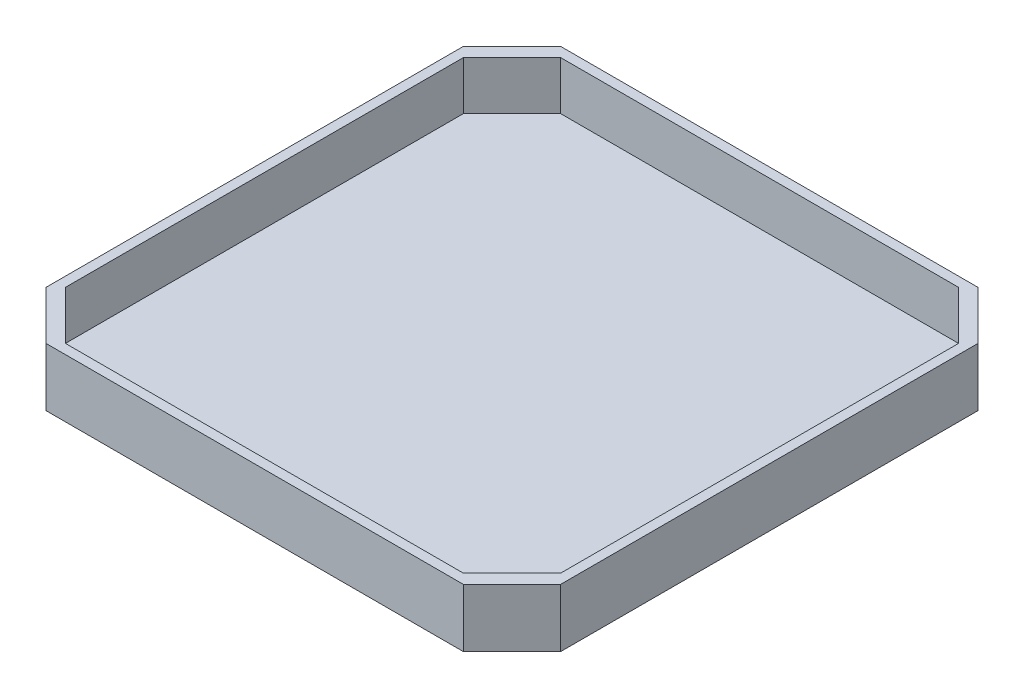
ISO-10303-21;
HEADER;
FILE_DESCRIPTION(('STEP AP214'),'2;1');
FILE_NAME('part.step','',(''),(''),'','','');
FILE_SCHEMA(('AUTOMOTIVE_DESIGN { 1 0 10303 214 1 1 1 1 }'));
ENDSEC;
DATA;
#1=APPLICATION_CONTEXT('core data for automotive mechanical design processes');
#2=APPLICATION_PROTOCOL_DEFINITION('international standard','automotive_design',2000,#1);
#3=PRODUCT_CONTEXT('',#1,'mechanical');
#4=PRODUCT('Part','Part','',(#3));
#5=PRODUCT_RELATED_PRODUCT_CATEGORY('part','',(#4));
#6=PRODUCT_DEFINITION_FORMATION('','',#4);
#7=PRODUCT_DEFINITION_CONTEXT('part definition',#1,'design');
#8=PRODUCT_DEFINITION('design','',#6,#7);
#9=PRODUCT_DEFINITION_SHAPE('','',#8);
#10=(LENGTH_UNIT() NAMED_UNIT(*) SI_UNIT(.MILLI.,.METRE.));
#11=(NAMED_UNIT(*) PLANE_ANGLE_UNIT() SI_UNIT($,.RADIAN.));
#12=(NAMED_UNIT(*) SI_UNIT($,.STERADIAN.) SOLID_ANGLE_UNIT());
#13=UNCERTAINTY_MEASURE_WITH_UNIT(LENGTH_MEASURE(1.E-05),#10,'distance_accuracy_value','');
#14=(GEOMETRIC_REPRESENTATION_CONTEXT(3) GLOBAL_UNCERTAINTY_ASSIGNED_CONTEXT((#13)) GLOBAL_UNIT_ASSIGNED_CONTEXT((#10,
#11,#12)) REPRESENTATION_CONTEXT('',''));
#15=CARTESIAN_POINT('',(0.,0.,0.));
#16=DIRECTION('',(0.,0.,1.));
#17=DIRECTION('',(1.,0.,0.));
#18=AXIS2_PLACEMENT_3D('',#15,#16,#17);
#19=CARTESIAN_POINT('',(-53.,2.,-53.));
#20=DIRECTION('',(1.,0.,0.));
#21=DIRECTION('',(0.,0.,-1.));
#22=AXIS2_PLACEMENT_3D('',#19,#20,#21);
#23=PLANE('',#22);
#24=DIRECTION('',(0.,0.,1.));
#25=VECTOR('',#24,1.);
#26=CARTESIAN_POINT('',(-53.,12.,-53.));
#27=LINE('',#26,#25);
#28=CARTESIAN_POINT('',(-53.,12.,-43.));
#29=VERTEX_POINT('',#28);
#30=CARTESIAN_POINT('',(-53.,12.,43.));
#31=VERTEX_POINT('',#30);
#32=EDGE_CURVE('E241',#29,#31,#27,.T.);
#33=ORIENTED_EDGE('',*,*,#32,.F.);
#34=DIRECTION('',(0.,-1.,0.));
#35=VECTOR('',#34,1.);
#36=CARTESIAN_POINT('',(-53.,2.,-43.));
#37=LINE('',#36,#35);
#38=CARTESIAN_POINT('',(-53.,0.,-43.));
#39=VERTEX_POINT('',#38);
#40=EDGE_CURVE('E213',#29,#39,#37,.T.);
#41=ORIENTED_EDGE('',*,*,#40,.T.);
#42=DIRECTION('',(0.,0.,1.));
#43=VECTOR('',#42,1.);
#44=CARTESIAN_POINT('',(-53.,0.,-53.));
#45=LINE('',#44,#43);
#46=CARTESIAN_POINT('',(-53.,0.,43.));
#47=VERTEX_POINT('',#46);
#48=EDGE_CURVE('E258',#39,#47,#45,.T.);
#49=ORIENTED_EDGE('',*,*,#48,.T.);
#50=DIRECTION('',(0.,1.,0.));
#51=VECTOR('',#50,1.);
#52=CARTESIAN_POINT('',(-53.,2.,43.));
#53=LINE('',#52,#51);
#54=EDGE_CURVE('E211',#47,#31,#53,.T.);
#55=ORIENTED_EDGE('',*,*,#54,.T.);
#56=EDGE_LOOP('',(#33,#41,#49,#55));
#57=FACE_BOUND('',#56,.T.);
#58=ADVANCED_FACE('F35',(#57),#23,.F.);
#59=CARTESIAN_POINT('',(-53.,2.,53.));
#60=DIRECTION('',(0.,0.,-1.));
#61=DIRECTION('',(-1.,0.,0.));
#62=AXIS2_PLACEMENT_3D('',#59,#60,#61);
#63=PLANE('',#62);
#64=DIRECTION('',(1.,0.,0.));
#65=VECTOR('',#64,1.);
#66=CARTESIAN_POINT('',(-53.,0.,53.));
#67=LINE('',#66,#65);
#68=CARTESIAN_POINT('',(-43.,0.,53.));
#69=VERTEX_POINT('',#68);
#70=CARTESIAN_POINT('',(43.,0.,53.));
#71=VERTEX_POINT('',#70);
#72=EDGE_CURVE('E272',#69,#71,#67,.T.);
#73=ORIENTED_EDGE('',*,*,#72,.T.);
#74=DIRECTION('',(0.,1.,0.));
#75=VECTOR('',#74,1.);
#76=CARTESIAN_POINT('',(43.,2.,53.));
#77=LINE('',#76,#75);
#78=CARTESIAN_POINT('',(43.,12.,53.));
#79=VERTEX_POINT('',#78);
#80=EDGE_CURVE('E219',#71,#79,#77,.T.);
#81=ORIENTED_EDGE('',*,*,#80,.T.);
#82=DIRECTION('',(1.,0.,0.));
#83=VECTOR('',#82,1.);
#84=CARTESIAN_POINT('',(-53.,12.,53.));
#85=LINE('',#84,#83);
#86=CARTESIAN_POINT('',(-43.,12.,53.));
#87=VERTEX_POINT('',#86);
#88=EDGE_CURVE('E252',#87,#79,#85,.T.);
#89=ORIENTED_EDGE('',*,*,#88,.F.);
#90=DIRECTION('',(0.,-1.,0.));
#91=VECTOR('',#90,1.);
#92=CARTESIAN_POINT('',(-43.,2.,53.));
#93=LINE('',#92,#91);
#94=EDGE_CURVE('E216',#87,#69,#93,.T.);
#95=ORIENTED_EDGE('',*,*,#94,.T.);
#96=EDGE_LOOP('',(#73,#81,#89,#95));
#97=FACE_BOUND('',#96,.T.);
#98=ADVANCED_FACE('F329',(#97),#63,.F.);
#99=CARTESIAN_POINT('',(53.,2.,-53.));
#100=DIRECTION('',(-1.,0.,0.));
#101=DIRECTION('',(0.,0.,1.));
#102=AXIS2_PLACEMENT_3D('',#99,#100,#101);
#103=PLANE('',#102);
#104=DIRECTION('',(0.,0.,-1.));
#105=VECTOR('',#104,1.);
#106=CARTESIAN_POINT('',(53.,0.,-53.));
#107=LINE('',#106,#105);
#108=CARTESIAN_POINT('',(53.,0.,43.));
#109=VERTEX_POINT('',#108);
#110=CARTESIAN_POINT('',(53.,0.,-43.));
#111=VERTEX_POINT('',#110);
#112=EDGE_CURVE('E174',#109,#111,#107,.T.);
#113=ORIENTED_EDGE('',*,*,#112,.T.);
#114=DIRECTION('',(0.,1.,0.));
#115=VECTOR('',#114,1.);
#116=CARTESIAN_POINT('',(53.,2.,-43.));
#117=LINE('',#116,#115);
#118=CARTESIAN_POINT('',(53.,12.,-43.));
#119=VERTEX_POINT('',#118);
#120=EDGE_CURVE('E209',#111,#119,#117,.T.);
#121=ORIENTED_EDGE('',*,*,#120,.T.);
#122=DIRECTION('',(0.,0.,-1.));
#123=VECTOR('',#122,1.);
#124=CARTESIAN_POINT('',(53.,12.,53.));
#125=LINE('',#124,#123);
#126=CARTESIAN_POINT('',(53.,12.,43.));
#127=VERTEX_POINT('',#126);
#128=EDGE_CURVE('E277',#127,#119,#125,.T.);
#129=ORIENTED_EDGE('',*,*,#128,.F.);
#130=DIRECTION('',(0.,-1.,0.));
#131=VECTOR('',#130,1.);
#132=CARTESIAN_POINT('',(53.,2.,43.));
#133=LINE('',#132,#131);
#134=EDGE_CURVE('E206',#127,#109,#133,.T.);
#135=ORIENTED_EDGE('',*,*,#134,.T.);
#136=EDGE_LOOP('',(#113,#121,#129,#135));
#137=FACE_BOUND('',#136,.T.);
#138=ADVANCED_FACE('F269',(#137),#103,.F.);
#139=CARTESIAN_POINT('',(-53.,2.,-53.));
#140=DIRECTION('',(0.,0.,1.));
#141=DIRECTION('',(1.,0.,0.));
#142=AXIS2_PLACEMENT_3D('',#139,#140,#141);
#143=PLANE('',#142);
#144=DIRECTION('',(-1.,0.,0.));
#145=VECTOR('',#144,1.);
#146=CARTESIAN_POINT('',(53.,12.,-53.));
#147=LINE('',#146,#145);
#148=CARTESIAN_POINT('',(43.,12.,-53.));
#149=VERTEX_POINT('',#148);
#150=CARTESIAN_POINT('',(-43.,12.,-53.));
#151=VERTEX_POINT('',#150);
#152=EDGE_CURVE('E244',#149,#151,#147,.T.);
#153=ORIENTED_EDGE('',*,*,#152,.F.);
#154=DIRECTION('',(0.,-1.,0.));
#155=VECTOR('',#154,1.);
#156=CARTESIAN_POINT('',(43.,2.,-53.));
#157=LINE('',#156,#155);
#158=CARTESIAN_POINT('',(43.,0.,-53.));
#159=VERTEX_POINT('',#158);
#160=EDGE_CURVE('E195',#149,#159,#157,.T.);
#161=ORIENTED_EDGE('',*,*,#160,.T.);
#162=DIRECTION('',(-1.,0.,0.));
#163=VECTOR('',#162,1.);
#164=CARTESIAN_POINT('',(-53.,0.,-53.));
#165=LINE('',#164,#163);
#166=CARTESIAN_POINT('',(-43.,0.,-53.));
#167=VERTEX_POINT('',#166);
#168=EDGE_CURVE('E170',#159,#167,#165,.T.);
#169=ORIENTED_EDGE('',*,*,#168,.T.);
#170=DIRECTION('',(0.,1.,0.));
#171=VECTOR('',#170,1.);
#172=CARTESIAN_POINT('',(-43.,2.,-53.));
#173=LINE('',#172,#171);
#174=EDGE_CURVE('E193',#167,#151,#173,.T.);
#175=ORIENTED_EDGE('',*,*,#174,.T.);
#176=EDGE_LOOP('',(#153,#161,#169,#175));
#177=FACE_BOUND('',#176,.T.);
#178=ADVANCED_FACE('F260',(#177),#143,.F.);
#179=CARTESIAN_POINT('',(0.,0.,0.));
#180=DIRECTION('',(0.,1.,0.));
#181=DIRECTION('',(0.,0.,1.));
#182=AXIS2_PLACEMENT_3D('',#179,#180,#181);
#183=PLANE('',#182);
#184=ORIENTED_EDGE('',*,*,#168,.F.);
#185=DIRECTION('',(-0.707106781186547,0.,-0.707106781186549));
#186=VECTOR('',#185,1.);
#187=CARTESIAN_POINT('',(43.,0.,-53.));
#188=LINE('',#187,#186);
#189=EDGE_CURVE('E204',#159,#111,#188,.F.);
#190=ORIENTED_EDGE('',*,*,#189,.T.);
#191=ORIENTED_EDGE('',*,*,#112,.F.);
#192=DIRECTION('',(0.707106781186549,0.,-0.707106781186546));
#193=VECTOR('',#192,1.);
#194=CARTESIAN_POINT('',(53.,0.,43.));
#195=LINE('',#194,#193);
#196=EDGE_CURVE('E200',#109,#71,#195,.F.);
#197=ORIENTED_EDGE('',*,*,#196,.T.);
#198=ORIENTED_EDGE('',*,*,#72,.F.);
#199=DIRECTION('',(0.707106781186547,0.,0.707106781186548));
#200=VECTOR('',#199,1.);
#201=CARTESIAN_POINT('',(-43.,0.,53.));
#202=LINE('',#201,#200);
#203=EDGE_CURVE('E198',#69,#47,#202,.F.);
#204=ORIENTED_EDGE('',*,*,#203,.T.);
#205=ORIENTED_EDGE('',*,*,#48,.F.);
#206=DIRECTION('',(-0.707106781186549,0.,0.707106781186546));
#207=VECTOR('',#206,1.);
#208=CARTESIAN_POINT('',(-53.,0.,-43.));
#209=LINE('',#208,#207);
#210=EDGE_CURVE('E202',#39,#167,#209,.F.);
#211=ORIENTED_EDGE('',*,*,#210,.T.);
#212=EDGE_LOOP('',(#184,#190,#191,#197,#198,#204,#205,#211));
#213=FACE_BOUND('',#212,.T.);
#214=ADVANCED_FACE('F257',(#213),#183,.F.);
#215=CARTESIAN_POINT('',(0.,12.,0.));
#216=DIRECTION('',(0.,1.,0.));
#217=DIRECTION('',(0.,0.,1.));
#218=AXIS2_PLACEMENT_3D('',#215,#216,#217);
#219=PLANE('',#218);
#220=ORIENTED_EDGE('',*,*,#128,.T.);
#221=DIRECTION('',(0.707106781186547,0.,0.707106781186549));
#222=VECTOR('',#221,1.);
#223=CARTESIAN_POINT('',(48.0000000000001,12.,-48.));
#224=LINE('',#223,#222);
#225=EDGE_CURVE('E11',#119,#149,#224,.F.);
#226=ORIENTED_EDGE('',*,*,#225,.T.);
#227=ORIENTED_EDGE('',*,*,#152,.T.);
#228=DIRECTION('',(0.707106781186549,0.,-0.707106781186546));
#229=VECTOR('',#228,1.);
#230=CARTESIAN_POINT('',(-47.9999999999999,12.,-48.0000000000001));
#231=LINE('',#230,#229);
#232=EDGE_CURVE('E43',#151,#29,#231,.F.);
#233=ORIENTED_EDGE('',*,*,#232,.T.);
#234=ORIENTED_EDGE('',*,*,#32,.T.);
#235=DIRECTION('',(-0.707106781186547,0.,-0.707106781186548));
#236=VECTOR('',#235,1.);
#237=CARTESIAN_POINT('',(-48.,12.,47.9999999999999));
#238=LINE('',#237,#236);
#239=EDGE_CURVE('E231',#31,#87,#238,.F.);
#240=ORIENTED_EDGE('',*,*,#239,.T.);
#241=ORIENTED_EDGE('',*,*,#88,.T.);
#242=DIRECTION('',(-0.707106781186549,0.,0.707106781186546));
#243=VECTOR('',#242,1.);
#244=CARTESIAN_POINT('',(47.9999999999999,12.,48.0000000000001));
#245=LINE('',#244,#243);
#246=EDGE_CURVE('E233',#79,#127,#245,.F.);
#247=ORIENTED_EDGE('',*,*,#246,.T.);
#248=EDGE_LOOP('',(#220,#226,#227,#233,#234,#240,#241,#247));
#249=FACE_BOUND('',#248,.T.);
#250=DIRECTION('',(0.,0.,1.));
#251=VECTOR('',#250,1.);
#252=CARTESIAN_POINT('',(-51.,12.,-51.));
#253=LINE('',#252,#251);
#254=CARTESIAN_POINT('',(-51.,12.,-41.));
#255=VERTEX_POINT('',#254);
#256=CARTESIAN_POINT('',(-51.,12.,40.9999999999999));
#257=VERTEX_POINT('',#256);
#258=EDGE_CURVE('E295',#255,#257,#253,.T.);
#259=ORIENTED_EDGE('',*,*,#258,.F.);
#260=DIRECTION('',(-0.707106781186551,0.,0.707106781186544));
#261=VECTOR('',#260,1.);
#262=CARTESIAN_POINT('',(-40.9999999999999,12.,-51.));
#263=LINE('',#262,#261);
#264=CARTESIAN_POINT('',(-40.9999999999999,12.,-51.));
#265=VERTEX_POINT('',#264);
#266=EDGE_CURVE('E50',#255,#265,#263,.F.);
#267=ORIENTED_EDGE('',*,*,#266,.T.);
#268=DIRECTION('',(-1.,0.,0.));
#269=VECTOR('',#268,1.);
#270=CARTESIAN_POINT('',(51.,12.,-51.));
#271=LINE('',#270,#269);
#272=CARTESIAN_POINT('',(41.0000000000001,12.,-51.));
#273=VERTEX_POINT('',#272);
#274=EDGE_CURVE('E286',#273,#265,#271,.T.);
#275=ORIENTED_EDGE('',*,*,#274,.F.);
#276=DIRECTION('',(-0.707106781186544,0.,-0.707106781186551));
#277=VECTOR('',#276,1.);
#278=CARTESIAN_POINT('',(51.,12.,-40.9999999999999));
#279=LINE('',#278,#277);
#280=CARTESIAN_POINT('',(51.,12.,-40.9999999999999));
#281=VERTEX_POINT('',#280);
#282=EDGE_CURVE('E228',#273,#281,#279,.F.);
#283=ORIENTED_EDGE('',*,*,#282,.T.);
#284=DIRECTION('',(0.,0.,-1.));
#285=VECTOR('',#284,1.);
#286=CARTESIAN_POINT('',(51.,12.,51.));
#287=LINE('',#286,#285);
#288=CARTESIAN_POINT('',(51.,12.,41.));
#289=VERTEX_POINT('',#288);
#290=EDGE_CURVE('E282',#289,#281,#287,.T.);
#291=ORIENTED_EDGE('',*,*,#290,.F.);
#292=DIRECTION('',(0.707106781186551,0.,-0.707106781186544));
#293=VECTOR('',#292,1.);
#294=CARTESIAN_POINT('',(40.9999999999999,12.,51.));
#295=LINE('',#294,#293);
#296=CARTESIAN_POINT('',(40.9999999999999,12.,51.));
#297=VERTEX_POINT('',#296);
#298=EDGE_CURVE('E226',#289,#297,#295,.F.);
#299=ORIENTED_EDGE('',*,*,#298,.T.);
#300=DIRECTION('',(1.,0.,0.));
#301=VECTOR('',#300,1.);
#302=CARTESIAN_POINT('',(-51.,12.,51.));
#303=LINE('',#302,#301);
#304=CARTESIAN_POINT('',(-41.,12.,51.));
#305=VERTEX_POINT('',#304);
#306=EDGE_CURVE('E292',#305,#297,#303,.T.);
#307=ORIENTED_EDGE('',*,*,#306,.F.);
#308=DIRECTION('',(0.707106781186544,0.,0.707106781186551));
#309=VECTOR('',#308,1.);
#310=CARTESIAN_POINT('',(-51.,12.,40.9999999999999));
#311=LINE('',#310,#309);
#312=EDGE_CURVE('E224',#305,#257,#311,.F.);
#313=ORIENTED_EDGE('',*,*,#312,.T.);
#314=EDGE_LOOP('',(#259,#267,#275,#283,#291,#299,#307,#313));
#315=FACE_BOUND('',#314,.T.);
#316=ADVANCED_FACE('F240',(#249,#315),#219,.T.);
#317=CARTESIAN_POINT('',(51.,12.,-51.));
#318=DIRECTION('',(0.,0.,1.));
#319=DIRECTION('',(1.,0.,0.));
#320=AXIS2_PLACEMENT_3D('',#317,#318,#319);
#321=PLANE('',#320);
#322=DIRECTION('',(-1.,0.,0.));
#323=VECTOR('',#322,1.);
#324=CARTESIAN_POINT('',(51.,2.,-51.));
#325=LINE('',#324,#323);
#326=CARTESIAN_POINT('',(41.0000000000001,2.,-51.));
#327=VERTEX_POINT('',#326);
#328=CARTESIAN_POINT('',(-40.9999999999999,2.,-51.));
#329=VERTEX_POINT('',#328);
#330=EDGE_CURVE('E153',#327,#329,#325,.T.);
#331=ORIENTED_EDGE('',*,*,#330,.F.);
#332=DIRECTION('',(0.,1.,0.));
#333=VECTOR('',#332,1.);
#334=CARTESIAN_POINT('',(41.0000000000001,12.,-51.));
#335=LINE('',#334,#333);
#336=EDGE_CURVE('E57',#327,#273,#335,.T.);
#337=ORIENTED_EDGE('',*,*,#336,.T.);
#338=ORIENTED_EDGE('',*,*,#274,.T.);
#339=DIRECTION('',(0.,-1.,0.));
#340=VECTOR('',#339,1.);
#341=CARTESIAN_POINT('',(-40.9999999999999,2.,-51.));
#342=LINE('',#341,#340);
#343=EDGE_CURVE('E221',#265,#329,#342,.T.);
#344=ORIENTED_EDGE('',*,*,#343,.T.);
#345=EDGE_LOOP('',(#331,#337,#338,#344));
#346=FACE_BOUND('',#345,.T.);
#347=ADVANCED_FACE('F297',(#346),#321,.T.);
#348=CARTESIAN_POINT('',(-51.,12.,-51.));
#349=DIRECTION('',(1.,0.,0.));
#350=DIRECTION('',(0.,0.,-1.));
#351=AXIS2_PLACEMENT_3D('',#348,#349,#350);
#352=PLANE('',#351);
#353=ORIENTED_EDGE('',*,*,#258,.T.);
#354=DIRECTION('',(0.,-1.,0.));
#355=VECTOR('',#354,1.);
#356=CARTESIAN_POINT('',(-51.,2.,40.9999999999999));
#357=LINE('',#356,#355);
#358=CARTESIAN_POINT('',(-51.,2.,40.9999999999999));
#359=VERTEX_POINT('',#358);
#360=EDGE_CURVE('E159',#257,#359,#357,.T.);
#361=ORIENTED_EDGE('',*,*,#360,.T.);
#362=DIRECTION('',(0.,0.,1.));
#363=VECTOR('',#362,1.);
#364=CARTESIAN_POINT('',(-51.,2.,-51.));
#365=LINE('',#364,#363);
#366=CARTESIAN_POINT('',(-51.,2.,-41.));
#367=VERTEX_POINT('',#366);
#368=EDGE_CURVE('E152',#367,#359,#365,.T.);
#369=ORIENTED_EDGE('',*,*,#368,.F.);
#370=DIRECTION('',(0.,1.,0.));
#371=VECTOR('',#370,1.);
#372=CARTESIAN_POINT('',(-51.,12.,-41.));
#373=LINE('',#372,#371);
#374=EDGE_CURVE('E165',#367,#255,#373,.T.);
#375=ORIENTED_EDGE('',*,*,#374,.T.);
#376=EDGE_LOOP('',(#353,#361,#369,#375));
#377=FACE_BOUND('',#376,.T.);
#378=ADVANCED_FACE('F164',(#377),#352,.T.);
#379=CARTESIAN_POINT('',(-51.,12.,51.));
#380=DIRECTION('',(0.,0.,-1.));
#381=DIRECTION('',(-1.,0.,0.));
#382=AXIS2_PLACEMENT_3D('',#379,#380,#381);
#383=PLANE('',#382);
#384=DIRECTION('',(1.,0.,0.));
#385=VECTOR('',#384,1.);
#386=CARTESIAN_POINT('',(-51.,2.,51.));
#387=LINE('',#386,#385);
#388=CARTESIAN_POINT('',(-41.,2.,51.));
#389=VERTEX_POINT('',#388);
#390=CARTESIAN_POINT('',(40.9999999999999,2.,51.));
#391=VERTEX_POINT('',#390);
#392=EDGE_CURVE('E167',#389,#391,#387,.T.);
#393=ORIENTED_EDGE('',*,*,#392,.F.);
#394=DIRECTION('',(0.,1.,0.));
#395=VECTOR('',#394,1.);
#396=CARTESIAN_POINT('',(-41.,12.,51.));
#397=LINE('',#396,#395);
#398=EDGE_CURVE('E186',#389,#305,#397,.T.);
#399=ORIENTED_EDGE('',*,*,#398,.T.);
#400=ORIENTED_EDGE('',*,*,#306,.T.);
#401=DIRECTION('',(0.,-1.,0.));
#402=VECTOR('',#401,1.);
#403=CARTESIAN_POINT('',(40.9999999999999,2.,51.));
#404=LINE('',#403,#402);
#405=EDGE_CURVE('E183',#297,#391,#404,.T.);
#406=ORIENTED_EDGE('',*,*,#405,.T.);
#407=EDGE_LOOP('',(#393,#399,#400,#406));
#408=FACE_BOUND('',#407,.T.);
#409=ADVANCED_FACE('F313',(#408),#383,.T.);
#410=CARTESIAN_POINT('',(51.,12.,51.));
#411=DIRECTION('',(-1.,0.,0.));
#412=DIRECTION('',(0.,0.,1.));
#413=AXIS2_PLACEMENT_3D('',#410,#411,#412);
#414=PLANE('',#413);
#415=DIRECTION('',(0.,0.,-1.));
#416=VECTOR('',#415,1.);
#417=CARTESIAN_POINT('',(51.,2.,51.));
#418=LINE('',#417,#416);
#419=CARTESIAN_POINT('',(51.,2.,41.));
#420=VERTEX_POINT('',#419);
#421=CARTESIAN_POINT('',(51.,2.,-41.));
#422=VERTEX_POINT('',#421);
#423=EDGE_CURVE('E283',#420,#422,#418,.T.);
#424=ORIENTED_EDGE('',*,*,#423,.F.);
#425=DIRECTION('',(0.,1.,0.));
#426=VECTOR('',#425,1.);
#427=CARTESIAN_POINT('',(51.,12.,41.));
#428=LINE('',#427,#426);
#429=EDGE_CURVE('E191',#420,#289,#428,.T.);
#430=ORIENTED_EDGE('',*,*,#429,.T.);
#431=ORIENTED_EDGE('',*,*,#290,.T.);
#432=DIRECTION('',(0.,-1.,0.));
#433=VECTOR('',#432,1.);
#434=CARTESIAN_POINT('',(51.,2.,-40.9999999999999));
#435=LINE('',#434,#433);
#436=EDGE_CURVE('E188',#281,#422,#435,.T.);
#437=ORIENTED_EDGE('',*,*,#436,.T.);
#438=EDGE_LOOP('',(#424,#430,#431,#437));
#439=FACE_BOUND('',#438,.T.);
#440=ADVANCED_FACE('F305',(#439),#414,.T.);
#441=CARTESIAN_POINT('',(0.,2.,0.));
#442=DIRECTION('',(0.,1.,0.));
#443=DIRECTION('',(0.,0.,1.));
#444=AXIS2_PLACEMENT_3D('',#441,#442,#443);
#445=PLANE('',#444);
#446=ORIENTED_EDGE('',*,*,#368,.T.);
#447=DIRECTION('',(-0.707106781186544,0.,-0.707106781186551));
#448=VECTOR('',#447,1.);
#449=CARTESIAN_POINT('',(-46.0000000000002,2.,45.9999999999998));
#450=LINE('',#449,#448);
#451=EDGE_CURVE('E181',#359,#389,#450,.F.);
#452=ORIENTED_EDGE('',*,*,#451,.T.);
#453=ORIENTED_EDGE('',*,*,#392,.T.);
#454=DIRECTION('',(-0.707106781186551,0.,0.707106781186544));
#455=VECTOR('',#454,1.);
#456=CARTESIAN_POINT('',(45.9999999999998,2.,46.0000000000002));
#457=LINE('',#456,#455);
#458=EDGE_CURVE('E179',#391,#420,#457,.F.);
#459=ORIENTED_EDGE('',*,*,#458,.T.);
#460=ORIENTED_EDGE('',*,*,#423,.T.);
#461=DIRECTION('',(0.707106781186544,0.,0.707106781186551));
#462=VECTOR('',#461,1.);
#463=CARTESIAN_POINT('',(46.0000000000003,2.,-45.9999999999998));
#464=LINE('',#463,#462);
#465=EDGE_CURVE('E158',#422,#327,#464,.F.);
#466=ORIENTED_EDGE('',*,*,#465,.T.);
#467=ORIENTED_EDGE('',*,*,#330,.T.);
#468=DIRECTION('',(0.707106781186551,0.,-0.707106781186544));
#469=VECTOR('',#468,1.);
#470=CARTESIAN_POINT('',(-45.9999999999997,2.,-46.0000000000002));
#471=LINE('',#470,#469);
#472=EDGE_CURVE('E149',#329,#367,#471,.F.);
#473=ORIENTED_EDGE('',*,*,#472,.T.);
#474=EDGE_LOOP('',(#446,#452,#453,#459,#460,#466,#467,#473));
#475=FACE_BOUND('',#474,.T.);
#476=ADVANCED_FACE('F151',(#475),#445,.T.);
#477=CARTESIAN_POINT('',(-51.,12.,40.9999999999999));
#478=DIRECTION('',(0.707106781186551,0.,-0.707106781186544));
#479=DIRECTION('',(0.,1.,0.));
#480=AXIS2_PLACEMENT_3D('',#477,#478,#479);
#481=PLANE('',#480);
#482=ORIENTED_EDGE('',*,*,#312,.F.);
#483=ORIENTED_EDGE('',*,*,#398,.F.);
#484=ORIENTED_EDGE('',*,*,#451,.F.);
#485=ORIENTED_EDGE('',*,*,#360,.F.);
#486=EDGE_LOOP('',(#482,#483,#484,#485));
#487=FACE_BOUND('',#486,.T.);
#488=ADVANCED_FACE('F318',(#487),#481,.T.);
#489=CARTESIAN_POINT('',(40.9999999999999,12.,51.));
#490=DIRECTION('',(-0.707106781186544,0.,-0.707106781186551));
#491=DIRECTION('',(0.,1.,0.));
#492=AXIS2_PLACEMENT_3D('',#489,#490,#491);
#493=PLANE('',#492);
#494=ORIENTED_EDGE('',*,*,#298,.F.);
#495=ORIENTED_EDGE('',*,*,#429,.F.);
#496=ORIENTED_EDGE('',*,*,#458,.F.);
#497=ORIENTED_EDGE('',*,*,#405,.F.);
#498=EDGE_LOOP('',(#494,#495,#496,#497));
#499=FACE_BOUND('',#498,.T.);
#500=ADVANCED_FACE('F311',(#499),#493,.T.);
#501=CARTESIAN_POINT('',(43.,2.,-53.));
#502=DIRECTION('',(-0.707106781186549,0.,0.707106781186547));
#503=DIRECTION('',(0.,-1.,0.));
#504=AXIS2_PLACEMENT_3D('',#501,#502,#503);
#505=PLANE('',#504);
#506=ORIENTED_EDGE('',*,*,#225,.F.);
#507=ORIENTED_EDGE('',*,*,#120,.F.);
#508=ORIENTED_EDGE('',*,*,#189,.F.);
#509=ORIENTED_EDGE('',*,*,#160,.F.);
#510=EDGE_LOOP('',(#506,#507,#508,#509));
#511=FACE_BOUND('',#510,.T.);
#512=ADVANCED_FACE('F264',(#511),#505,.F.);
#513=CARTESIAN_POINT('',(-53.,2.,-43.));
#514=DIRECTION('',(0.707106781186546,0.,0.707106781186549));
#515=DIRECTION('',(0.,-1.,0.));
#516=AXIS2_PLACEMENT_3D('',#513,#514,#515);
#517=PLANE('',#516);
#518=ORIENTED_EDGE('',*,*,#232,.F.);
#519=ORIENTED_EDGE('',*,*,#174,.F.);
#520=ORIENTED_EDGE('',*,*,#210,.F.);
#521=ORIENTED_EDGE('',*,*,#40,.F.);
#522=EDGE_LOOP('',(#518,#519,#520,#521));
#523=FACE_BOUND('',#522,.T.);
#524=ADVANCED_FACE('F254',(#523),#517,.F.);
#525=CARTESIAN_POINT('',(53.,2.,43.));
#526=DIRECTION('',(-0.707106781186546,0.,-0.707106781186549));
#527=DIRECTION('',(0.,-1.,0.));
#528=AXIS2_PLACEMENT_3D('',#525,#526,#527);
#529=PLANE('',#528);
#530=ORIENTED_EDGE('',*,*,#246,.F.);
#531=ORIENTED_EDGE('',*,*,#80,.F.);
#532=ORIENTED_EDGE('',*,*,#196,.F.);
#533=ORIENTED_EDGE('',*,*,#134,.F.);
#534=EDGE_LOOP('',(#530,#531,#532,#533));
#535=FACE_BOUND('',#534,.T.);
#536=ADVANCED_FACE('F388',(#535),#529,.F.);
#537=CARTESIAN_POINT('',(51.,12.,-40.9999999999999));
#538=DIRECTION('',(-0.707106781186551,0.,0.707106781186544));
#539=DIRECTION('',(0.,1.,0.));
#540=AXIS2_PLACEMENT_3D('',#537,#538,#539);
#541=PLANE('',#540);
#542=ORIENTED_EDGE('',*,*,#282,.F.);
#543=ORIENTED_EDGE('',*,*,#336,.F.);
#544=ORIENTED_EDGE('',*,*,#465,.F.);
#545=ORIENTED_EDGE('',*,*,#436,.F.);
#546=EDGE_LOOP('',(#542,#543,#544,#545));
#547=FACE_BOUND('',#546,.T.);
#548=ADVANCED_FACE('F302',(#547),#541,.T.);
#549=CARTESIAN_POINT('',(-40.9999999999999,12.,-51.));
#550=DIRECTION('',(0.707106781186544,0.,0.707106781186552));
#551=DIRECTION('',(0.,1.,0.));
#552=AXIS2_PLACEMENT_3D('',#549,#550,#551);
#553=PLANE('',#552);
#554=ORIENTED_EDGE('',*,*,#266,.F.);
#555=ORIENTED_EDGE('',*,*,#374,.F.);
#556=ORIENTED_EDGE('',*,*,#472,.F.);
#557=ORIENTED_EDGE('',*,*,#343,.F.);
#558=EDGE_LOOP('',(#554,#555,#556,#557));
#559=FACE_BOUND('',#558,.T.);
#560=ADVANCED_FACE('F169',(#559),#553,.T.);
#561=CARTESIAN_POINT('',(-43.,2.,53.));
#562=DIRECTION('',(0.707106781186548,0.,-0.707106781186547));
#563=DIRECTION('',(0.,-1.,0.));
#564=AXIS2_PLACEMENT_3D('',#561,#562,#563);
#565=PLANE('',#564);
#566=ORIENTED_EDGE('',*,*,#239,.F.);
#567=ORIENTED_EDGE('',*,*,#54,.F.);
#568=ORIENTED_EDGE('',*,*,#203,.F.);
#569=ORIENTED_EDGE('',*,*,#94,.F.);
#570=EDGE_LOOP('',(#566,#567,#568,#569));
#571=FACE_BOUND('',#570,.T.);
#572=ADVANCED_FACE('F37',(#571),#565,.F.);
#573=CLOSED_SHELL('',(#58,#98,#138,#178,#214,#316,#347,#378,#409,#440,#476,#488,#500,#512,#524,
#536,#548,#560,#572));
#574=MANIFOLD_SOLID_BREP('B2',#573);
#575=ADVANCED_BREP_SHAPE_REPRESENTATION('',(#18,#574),#14);
#576=SHAPE_DEFINITION_REPRESENTATION(#9,#575);
ENDSEC;
END-ISO-10303-21;
